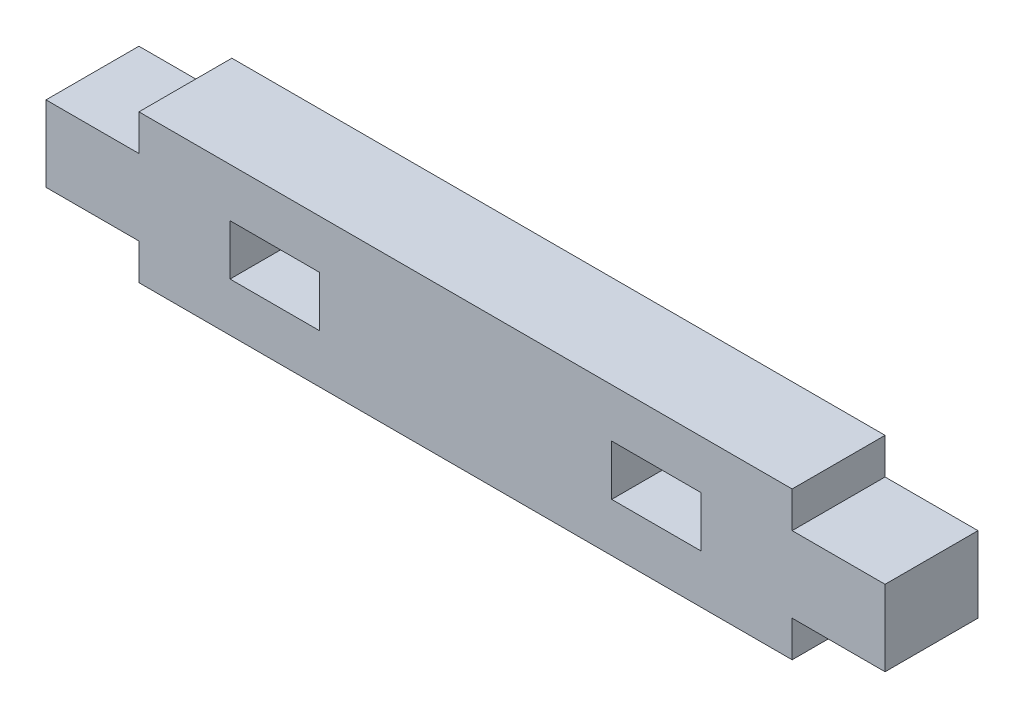
ISO-10303-21;
HEADER;
FILE_DESCRIPTION(('STEP AP214'),'2;1');
FILE_NAME('part.step','',(''),(''),'','','');
FILE_SCHEMA(('AUTOMOTIVE_DESIGN { 1 0 10303 214 1 1 1 1 }'));
ENDSEC;
DATA;
#1=APPLICATION_CONTEXT('core data for automotive mechanical design processes');
#2=APPLICATION_PROTOCOL_DEFINITION('international standard','automotive_design',2000,#1);
#3=PRODUCT_CONTEXT('',#1,'mechanical');
#4=PRODUCT('Part','Part','',(#3));
#5=PRODUCT_RELATED_PRODUCT_CATEGORY('part','',(#4));
#6=PRODUCT_DEFINITION_FORMATION('','',#4);
#7=PRODUCT_DEFINITION_CONTEXT('part definition',#1,'design');
#8=PRODUCT_DEFINITION('design','',#6,#7);
#9=PRODUCT_DEFINITION_SHAPE('','',#8);
#10=(LENGTH_UNIT() NAMED_UNIT(*) SI_UNIT(.MILLI.,.METRE.));
#11=(NAMED_UNIT(*) PLANE_ANGLE_UNIT() SI_UNIT($,.RADIAN.));
#12=(NAMED_UNIT(*) SI_UNIT($,.STERADIAN.) SOLID_ANGLE_UNIT());
#13=UNCERTAINTY_MEASURE_WITH_UNIT(LENGTH_MEASURE(1.E-05),#10,'distance_accuracy_value','');
#14=(GEOMETRIC_REPRESENTATION_CONTEXT(3) GLOBAL_UNCERTAINTY_ASSIGNED_CONTEXT((#13)) GLOBAL_UNIT_ASSIGNED_CONTEXT((#10,
#11,#12)) REPRESENTATION_CONTEXT('',''));
#15=CARTESIAN_POINT('',(0.,0.,0.));
#16=DIRECTION('',(0.,0.,1.));
#17=DIRECTION('',(1.,0.,0.));
#18=AXIS2_PLACEMENT_3D('',#15,#16,#17);
#19=CARTESIAN_POINT('',(-18.1,1.9,5.15));
#20=DIRECTION('',(0.,0.,-1.));
#21=DIRECTION('',(-1.,0.,0.));
#22=AXIS2_PLACEMENT_3D('',#19,#20,#21);
#23=PLANE('',#22);
#24=DIRECTION('',(1.,0.,0.));
#25=VECTOR('',#24,1.);
#26=CARTESIAN_POINT('',(8.1,2.6,5.15));
#27=LINE('',#26,#25);
#28=CARTESIAN_POINT('',(8.1,2.6,5.15));
#29=VERTEX_POINT('',#28);
#30=CARTESIAN_POINT('',(13.05,2.6,5.15));
#31=VERTEX_POINT('',#30);
#32=EDGE_CURVE('E188',#29,#31,#27,.T.);
#33=ORIENTED_EDGE('',*,*,#32,.F.);
#34=DIRECTION('',(0.,-1.,0.));
#35=VECTOR('',#34,1.);
#36=CARTESIAN_POINT('',(8.1,5.4,5.15));
#37=LINE('',#36,#35);
#38=CARTESIAN_POINT('',(8.1,5.4,5.15));
#39=VERTEX_POINT('',#38);
#40=EDGE_CURVE('E47',#39,#29,#37,.T.);
#41=ORIENTED_EDGE('',*,*,#40,.F.);
#42=DIRECTION('',(1.,0.,0.));
#43=VECTOR('',#42,1.);
#44=CARTESIAN_POINT('',(8.1,5.4,5.15));
#45=LINE('',#44,#43);
#46=CARTESIAN_POINT('',(13.05,5.4,5.15));
#47=VERTEX_POINT('',#46);
#48=EDGE_CURVE('E178',#39,#47,#45,.T.);
#49=ORIENTED_EDGE('',*,*,#48,.T.);
#50=DIRECTION('',(0.,-1.,0.));
#51=VECTOR('',#50,1.);
#52=CARTESIAN_POINT('',(13.05,5.4,5.15));
#53=LINE('',#52,#51);
#54=EDGE_CURVE('E184',#47,#31,#53,.T.);
#55=ORIENTED_EDGE('',*,*,#54,.T.);
#56=EDGE_LOOP('',(#33,#41,#49,#55));
#57=FACE_BOUND('',#56,.T.);
#58=DIRECTION('',(1.,0.,0.));
#59=VECTOR('',#58,1.);
#60=CARTESIAN_POINT('',(-23.25,1.9,5.15));
#61=LINE('',#60,#59);
#62=CARTESIAN_POINT('',(-23.25,1.9,5.15));
#63=VERTEX_POINT('',#62);
#64=CARTESIAN_POINT('',(-18.1,1.9,5.15));
#65=VERTEX_POINT('',#64);
#66=EDGE_CURVE('E235',#63,#65,#61,.T.);
#67=ORIENTED_EDGE('',*,*,#66,.T.);
#68=DIRECTION('',(0.,-1.,0.));
#69=VECTOR('',#68,1.);
#70=CARTESIAN_POINT('',(-18.1,1.9,5.15));
#71=LINE('',#70,#69);
#72=CARTESIAN_POINT('',(-18.1,-0.1,5.15));
#73=VERTEX_POINT('',#72);
#74=EDGE_CURVE('E238',#65,#73,#71,.T.);
#75=ORIENTED_EDGE('',*,*,#74,.T.);
#76=DIRECTION('',(1.,0.,0.));
#77=VECTOR('',#76,1.);
#78=CARTESIAN_POINT('',(-18.1,-0.1,5.15));
#79=LINE('',#78,#77);
#80=CARTESIAN_POINT('',(18.1,-0.0999999999999998,5.15));
#81=VERTEX_POINT('',#80);
#82=EDGE_CURVE('E241',#73,#81,#79,.T.);
#83=ORIENTED_EDGE('',*,*,#82,.T.);
#84=DIRECTION('',(0.,1.,0.));
#85=VECTOR('',#84,1.);
#86=CARTESIAN_POINT('',(18.1,1.9,5.15));
#87=LINE('',#86,#85);
#88=CARTESIAN_POINT('',(18.1,1.9,5.15));
#89=VERTEX_POINT('',#88);
#90=EDGE_CURVE('E243',#81,#89,#87,.T.);
#91=ORIENTED_EDGE('',*,*,#90,.T.);
#92=DIRECTION('',(1.,0.,0.));
#93=VECTOR('',#92,1.);
#94=CARTESIAN_POINT('',(23.25,1.9,5.15));
#95=LINE('',#94,#93);
#96=CARTESIAN_POINT('',(23.25,1.9,5.15));
#97=VERTEX_POINT('',#96);
#98=EDGE_CURVE('E245',#89,#97,#95,.T.);
#99=ORIENTED_EDGE('',*,*,#98,.T.);
#100=DIRECTION('',(0.,1.,0.));
#101=VECTOR('',#100,1.);
#102=CARTESIAN_POINT('',(23.25,6.1,5.15));
#103=LINE('',#102,#101);
#104=CARTESIAN_POINT('',(23.25,6.1,5.15));
#105=VERTEX_POINT('',#104);
#106=EDGE_CURVE('E247',#97,#105,#103,.T.);
#107=ORIENTED_EDGE('',*,*,#106,.T.);
#108=DIRECTION('',(-1.,0.,0.));
#109=VECTOR('',#108,1.);
#110=CARTESIAN_POINT('',(18.1,6.1,5.15));
#111=LINE('',#110,#109);
#112=CARTESIAN_POINT('',(18.1,6.1,5.15));
#113=VERTEX_POINT('',#112);
#114=EDGE_CURVE('E249',#105,#113,#111,.T.);
#115=ORIENTED_EDGE('',*,*,#114,.T.);
#116=DIRECTION('',(0.,1.,0.));
#117=VECTOR('',#116,1.);
#118=CARTESIAN_POINT('',(18.1,8.1,5.15));
#119=LINE('',#118,#117);
#120=CARTESIAN_POINT('',(18.1,8.1,5.15));
#121=VERTEX_POINT('',#120);
#122=EDGE_CURVE('E251',#113,#121,#119,.T.);
#123=ORIENTED_EDGE('',*,*,#122,.T.);
#124=DIRECTION('',(-1.,0.,0.));
#125=VECTOR('',#124,1.);
#126=CARTESIAN_POINT('',(-18.1,8.1,5.15));
#127=LINE('',#126,#125);
#128=CARTESIAN_POINT('',(-18.1,8.1,5.15));
#129=VERTEX_POINT('',#128);
#130=EDGE_CURVE('E253',#121,#129,#127,.T.);
#131=ORIENTED_EDGE('',*,*,#130,.T.);
#132=DIRECTION('',(0.,-1.,0.));
#133=VECTOR('',#132,1.);
#134=CARTESIAN_POINT('',(-18.1,8.1,5.15));
#135=LINE('',#134,#133);
#136=CARTESIAN_POINT('',(-18.1,6.1,5.15));
#137=VERTEX_POINT('',#136);
#138=EDGE_CURVE('E255',#129,#137,#135,.T.);
#139=ORIENTED_EDGE('',*,*,#138,.T.);
#140=DIRECTION('',(-1.,0.,0.));
#141=VECTOR('',#140,1.);
#142=CARTESIAN_POINT('',(-18.1,6.1,5.15));
#143=LINE('',#142,#141);
#144=CARTESIAN_POINT('',(-23.25,6.1,5.15));
#145=VERTEX_POINT('',#144);
#146=EDGE_CURVE('E257',#137,#145,#143,.T.);
#147=ORIENTED_EDGE('',*,*,#146,.T.);
#148=DIRECTION('',(0.,-1.,0.));
#149=VECTOR('',#148,1.);
#150=CARTESIAN_POINT('',(-23.25,6.1,5.15));
#151=LINE('',#150,#149);
#152=EDGE_CURVE('E259',#145,#63,#151,.T.);
#153=ORIENTED_EDGE('',*,*,#152,.T.);
#154=EDGE_LOOP('',(#67,#75,#83,#91,#99,#107,#115,#123,#131,#139,#147,#153));
#155=FACE_BOUND('',#154,.T.);
#156=DIRECTION('',(0.,-1.,0.));
#157=VECTOR('',#156,1.);
#158=CARTESIAN_POINT('',(-8.1,0.,5.15));
#159=LINE('',#158,#157);
#160=CARTESIAN_POINT('',(-8.1,5.4,5.15));
#161=VERTEX_POINT('',#160);
#162=CARTESIAN_POINT('',(-8.1,2.6,5.15));
#163=VERTEX_POINT('',#162);
#164=EDGE_CURVE('E189',#161,#163,#159,.T.);
#165=ORIENTED_EDGE('',*,*,#164,.T.);
#166=DIRECTION('',(-1.,0.,0.));
#167=VECTOR('',#166,1.);
#168=CARTESIAN_POINT('',(0.,2.6,5.15));
#169=LINE('',#168,#167);
#170=CARTESIAN_POINT('',(-13.05,2.6,5.15));
#171=VERTEX_POINT('',#170);
#172=EDGE_CURVE('E209',#163,#171,#169,.T.);
#173=ORIENTED_EDGE('',*,*,#172,.T.);
#174=DIRECTION('',(0.,-1.,0.));
#175=VECTOR('',#174,1.);
#176=CARTESIAN_POINT('',(-13.05,0.,5.15));
#177=LINE('',#176,#175);
#178=CARTESIAN_POINT('',(-13.05,5.4,5.15));
#179=VERTEX_POINT('',#178);
#180=EDGE_CURVE('E220',#179,#171,#177,.T.);
#181=ORIENTED_EDGE('',*,*,#180,.F.);
#182=DIRECTION('',(-1.,0.,0.));
#183=VECTOR('',#182,1.);
#184=CARTESIAN_POINT('',(0.,5.4,5.15));
#185=LINE('',#184,#183);
#186=EDGE_CURVE('E192',#161,#179,#185,.T.);
#187=ORIENTED_EDGE('',*,*,#186,.F.);
#188=EDGE_LOOP('',(#165,#173,#181,#187));
#189=FACE_BOUND('',#188,.T.);
#190=ADVANCED_FACE('F32',(#57,#155,#189),#23,.F.);
#191=CARTESIAN_POINT('',(-18.1,1.9,0.));
#192=DIRECTION('',(0.,0.,-1.));
#193=DIRECTION('',(-1.,0.,0.));
#194=AXIS2_PLACEMENT_3D('',#191,#192,#193);
#195=PLANE('',#194);
#196=DIRECTION('',(0.,-1.,0.));
#197=VECTOR('',#196,1.);
#198=CARTESIAN_POINT('',(8.1,5.4,0.));
#199=LINE('',#198,#197);
#200=CARTESIAN_POINT('',(8.1,5.4,0.));
#201=VERTEX_POINT('',#200);
#202=CARTESIAN_POINT('',(8.1,2.6,0.));
#203=VERTEX_POINT('',#202);
#204=EDGE_CURVE('E172',#201,#203,#199,.T.);
#205=ORIENTED_EDGE('',*,*,#204,.T.);
#206=DIRECTION('',(1.,0.,0.));
#207=VECTOR('',#206,1.);
#208=CARTESIAN_POINT('',(8.1,2.6,0.));
#209=LINE('',#208,#207);
#210=CARTESIAN_POINT('',(13.05,2.6,0.));
#211=VERTEX_POINT('',#210);
#212=EDGE_CURVE('E202',#203,#211,#209,.T.);
#213=ORIENTED_EDGE('',*,*,#212,.T.);
#214=DIRECTION('',(0.,-1.,0.));
#215=VECTOR('',#214,1.);
#216=CARTESIAN_POINT('',(13.05,5.4,0.));
#217=LINE('',#216,#215);
#218=CARTESIAN_POINT('',(13.05,5.4,0.));
#219=VERTEX_POINT('',#218);
#220=EDGE_CURVE('E199',#219,#211,#217,.T.);
#221=ORIENTED_EDGE('',*,*,#220,.F.);
#222=DIRECTION('',(1.,0.,0.));
#223=VECTOR('',#222,1.);
#224=CARTESIAN_POINT('',(8.1,5.4,0.));
#225=LINE('',#224,#223);
#226=EDGE_CURVE('E197',#201,#219,#225,.T.);
#227=ORIENTED_EDGE('',*,*,#226,.F.);
#228=EDGE_LOOP('',(#205,#213,#221,#227));
#229=FACE_BOUND('',#228,.T.);
#230=DIRECTION('',(1.,0.,0.));
#231=VECTOR('',#230,1.);
#232=CARTESIAN_POINT('',(-23.25,1.9,0.));
#233=LINE('',#232,#231);
#234=CARTESIAN_POINT('',(-23.25,1.9,0.));
#235=VERTEX_POINT('',#234);
#236=CARTESIAN_POINT('',(-18.1,1.9,0.));
#237=VERTEX_POINT('',#236);
#238=EDGE_CURVE('E228',#235,#237,#233,.T.);
#239=ORIENTED_EDGE('',*,*,#238,.F.);
#240=DIRECTION('',(0.,-1.,0.));
#241=VECTOR('',#240,1.);
#242=CARTESIAN_POINT('',(-23.25,6.1,0.));
#243=LINE('',#242,#241);
#244=CARTESIAN_POINT('',(-23.25,6.1,0.));
#245=VERTEX_POINT('',#244);
#246=EDGE_CURVE('E239',#245,#235,#243,.T.);
#247=ORIENTED_EDGE('',*,*,#246,.F.);
#248=DIRECTION('',(-1.,0.,0.));
#249=VECTOR('',#248,1.);
#250=CARTESIAN_POINT('',(-18.1,6.1,0.));
#251=LINE('',#250,#249);
#252=CARTESIAN_POINT('',(-18.1,6.1,0.));
#253=VERTEX_POINT('',#252);
#254=EDGE_CURVE('E283',#253,#245,#251,.T.);
#255=ORIENTED_EDGE('',*,*,#254,.F.);
#256=DIRECTION('',(0.,-1.,0.));
#257=VECTOR('',#256,1.);
#258=CARTESIAN_POINT('',(-18.1,8.1,0.));
#259=LINE('',#258,#257);
#260=CARTESIAN_POINT('',(-18.1,8.1,0.));
#261=VERTEX_POINT('',#260);
#262=EDGE_CURVE('E281',#261,#253,#259,.T.);
#263=ORIENTED_EDGE('',*,*,#262,.F.);
#264=DIRECTION('',(-1.,0.,0.));
#265=VECTOR('',#264,1.);
#266=CARTESIAN_POINT('',(-18.1,8.1,0.));
#267=LINE('',#266,#265);
#268=CARTESIAN_POINT('',(18.1,8.1,0.));
#269=VERTEX_POINT('',#268);
#270=EDGE_CURVE('E279',#269,#261,#267,.T.);
#271=ORIENTED_EDGE('',*,*,#270,.F.);
#272=DIRECTION('',(0.,1.,0.));
#273=VECTOR('',#272,1.);
#274=CARTESIAN_POINT('',(18.1,8.1,0.));
#275=LINE('',#274,#273);
#276=CARTESIAN_POINT('',(18.1,6.1,0.));
#277=VERTEX_POINT('',#276);
#278=EDGE_CURVE('E277',#277,#269,#275,.T.);
#279=ORIENTED_EDGE('',*,*,#278,.F.);
#280=DIRECTION('',(-1.,0.,0.));
#281=VECTOR('',#280,1.);
#282=CARTESIAN_POINT('',(18.1,6.1,0.));
#283=LINE('',#282,#281);
#284=CARTESIAN_POINT('',(23.25,6.1,0.));
#285=VERTEX_POINT('',#284);
#286=EDGE_CURVE('E275',#285,#277,#283,.T.);
#287=ORIENTED_EDGE('',*,*,#286,.F.);
#288=DIRECTION('',(0.,1.,0.));
#289=VECTOR('',#288,1.);
#290=CARTESIAN_POINT('',(23.25,6.1,0.));
#291=LINE('',#290,#289);
#292=CARTESIAN_POINT('',(23.25,1.9,0.));
#293=VERTEX_POINT('',#292);
#294=EDGE_CURVE('E273',#293,#285,#291,.T.);
#295=ORIENTED_EDGE('',*,*,#294,.F.);
#296=DIRECTION('',(1.,0.,0.));
#297=VECTOR('',#296,1.);
#298=CARTESIAN_POINT('',(23.25,1.9,0.));
#299=LINE('',#298,#297);
#300=CARTESIAN_POINT('',(18.1,1.9,0.));
#301=VERTEX_POINT('',#300);
#302=EDGE_CURVE('E271',#301,#293,#299,.T.);
#303=ORIENTED_EDGE('',*,*,#302,.F.);
#304=DIRECTION('',(0.,1.,0.));
#305=VECTOR('',#304,1.);
#306=CARTESIAN_POINT('',(18.1,1.9,0.));
#307=LINE('',#306,#305);
#308=CARTESIAN_POINT('',(18.1,-0.0999999999999998,0.));
#309=VERTEX_POINT('',#308);
#310=EDGE_CURVE('E269',#309,#301,#307,.T.);
#311=ORIENTED_EDGE('',*,*,#310,.F.);
#312=DIRECTION('',(1.,0.,0.));
#313=VECTOR('',#312,1.);
#314=CARTESIAN_POINT('',(18.1,-0.0999999999999998,0.));
#315=LINE('',#314,#313);
#316=CARTESIAN_POINT('',(-18.1,-0.1,0.));
#317=VERTEX_POINT('',#316);
#318=EDGE_CURVE('E267',#317,#309,#315,.T.);
#319=ORIENTED_EDGE('',*,*,#318,.F.);
#320=DIRECTION('',(0.,-1.,0.));
#321=VECTOR('',#320,1.);
#322=CARTESIAN_POINT('',(-18.1,1.9,0.));
#323=LINE('',#322,#321);
#324=EDGE_CURVE('E264',#237,#317,#323,.T.);
#325=ORIENTED_EDGE('',*,*,#324,.F.);
#326=EDGE_LOOP('',(#239,#247,#255,#263,#271,#279,#287,#295,#303,#311,#319,#325));
#327=FACE_BOUND('',#326,.T.);
#328=DIRECTION('',(-1.,0.,0.));
#329=VECTOR('',#328,1.);
#330=CARTESIAN_POINT('',(0.,2.6,0.));
#331=LINE('',#330,#329);
#332=CARTESIAN_POINT('',(-8.1,2.6,0.));
#333=VERTEX_POINT('',#332);
#334=CARTESIAN_POINT('',(-13.05,2.6,0.));
#335=VERTEX_POINT('',#334);
#336=EDGE_CURVE('E215',#333,#335,#331,.T.);
#337=ORIENTED_EDGE('',*,*,#336,.F.);
#338=DIRECTION('',(0.,-1.,0.));
#339=VECTOR('',#338,1.);
#340=CARTESIAN_POINT('',(-8.1,0.,0.));
#341=LINE('',#340,#339);
#342=CARTESIAN_POINT('',(-8.1,5.4,0.));
#343=VERTEX_POINT('',#342);
#344=EDGE_CURVE('E206',#343,#333,#341,.T.);
#345=ORIENTED_EDGE('',*,*,#344,.F.);
#346=DIRECTION('',(-1.,0.,0.));
#347=VECTOR('',#346,1.);
#348=CARTESIAN_POINT('',(0.,5.4,0.));
#349=LINE('',#348,#347);
#350=CARTESIAN_POINT('',(-13.05,5.4,0.));
#351=VERTEX_POINT('',#350);
#352=EDGE_CURVE('E208',#343,#351,#349,.T.);
#353=ORIENTED_EDGE('',*,*,#352,.T.);
#354=DIRECTION('',(0.,-1.,0.));
#355=VECTOR('',#354,1.);
#356=CARTESIAN_POINT('',(-13.05,0.,0.));
#357=LINE('',#356,#355);
#358=EDGE_CURVE('E212',#351,#335,#357,.T.);
#359=ORIENTED_EDGE('',*,*,#358,.T.);
#360=EDGE_LOOP('',(#337,#345,#353,#359));
#361=FACE_BOUND('',#360,.T.);
#362=ADVANCED_FACE('F325',(#229,#327,#361),#195,.T.);
#363=CARTESIAN_POINT('',(-23.25,1.9,5.15));
#364=DIRECTION('',(0.,1.,0.));
#365=DIRECTION('',(0.,0.,1.));
#366=AXIS2_PLACEMENT_3D('',#363,#364,#365);
#367=PLANE('',#366);
#368=ORIENTED_EDGE('',*,*,#238,.T.);
#369=DIRECTION('',(0.,0.,-1.));
#370=VECTOR('',#369,1.);
#371=CARTESIAN_POINT('',(-18.1,1.9,5.15));
#372=LINE('',#371,#370);
#373=EDGE_CURVE('E11',#65,#237,#372,.T.);
#374=ORIENTED_EDGE('',*,*,#373,.F.);
#375=ORIENTED_EDGE('',*,*,#66,.F.);
#376=DIRECTION('',(0.,0.,-1.));
#377=VECTOR('',#376,1.);
#378=CARTESIAN_POINT('',(-23.25,1.9,5.15));
#379=LINE('',#378,#377);
#380=EDGE_CURVE('E261',#63,#235,#379,.T.);
#381=ORIENTED_EDGE('',*,*,#380,.T.);
#382=EDGE_LOOP('',(#368,#374,#375,#381));
#383=FACE_BOUND('',#382,.T.);
#384=ADVANCED_FACE('F34',(#383),#367,.F.);
#385=CARTESIAN_POINT('',(-18.1,1.9,5.15));
#386=DIRECTION('',(1.,0.,0.));
#387=DIRECTION('',(0.,0.,-1.));
#388=AXIS2_PLACEMENT_3D('',#385,#386,#387);
#389=PLANE('',#388);
#390=ORIENTED_EDGE('',*,*,#324,.T.);
#391=DIRECTION('',(0.,0.,-1.));
#392=VECTOR('',#391,1.);
#393=CARTESIAN_POINT('',(-18.1,-0.1,5.15));
#394=LINE('',#393,#392);
#395=EDGE_CURVE('E40',#73,#317,#394,.T.);
#396=ORIENTED_EDGE('',*,*,#395,.F.);
#397=ORIENTED_EDGE('',*,*,#74,.F.);
#398=ORIENTED_EDGE('',*,*,#373,.T.);
#399=EDGE_LOOP('',(#390,#396,#397,#398));
#400=FACE_BOUND('',#399,.T.);
#401=ADVANCED_FACE('F321',(#400),#389,.F.);
#402=CARTESIAN_POINT('',(18.1,-0.0999999999999998,5.15));
#403=DIRECTION('',(0.,1.,0.));
#404=DIRECTION('',(-1.,0.,0.));
#405=AXIS2_PLACEMENT_3D('',#402,#403,#404);
#406=PLANE('',#405);
#407=ORIENTED_EDGE('',*,*,#318,.T.);
#408=DIRECTION('',(0.,0.,-1.));
#409=VECTOR('',#408,1.);
#410=CARTESIAN_POINT('',(18.1,-0.0999999999999998,5.15));
#411=LINE('',#410,#409);
#412=EDGE_CURVE('E312',#81,#309,#411,.T.);
#413=ORIENTED_EDGE('',*,*,#412,.F.);
#414=ORIENTED_EDGE('',*,*,#82,.F.);
#415=ORIENTED_EDGE('',*,*,#395,.T.);
#416=EDGE_LOOP('',(#407,#413,#414,#415));
#417=FACE_BOUND('',#416,.T.);
#418=ADVANCED_FACE('F318',(#417),#406,.F.);
#419=CARTESIAN_POINT('',(18.1,1.9,5.15));
#420=DIRECTION('',(-1.,0.,0.));
#421=DIRECTION('',(0.,0.,1.));
#422=AXIS2_PLACEMENT_3D('',#419,#420,#421);
#423=PLANE('',#422);
#424=ORIENTED_EDGE('',*,*,#310,.T.);
#425=DIRECTION('',(0.,0.,-1.));
#426=VECTOR('',#425,1.);
#427=CARTESIAN_POINT('',(18.1,1.9,5.15));
#428=LINE('',#427,#426);
#429=EDGE_CURVE('E309',#89,#301,#428,.T.);
#430=ORIENTED_EDGE('',*,*,#429,.F.);
#431=ORIENTED_EDGE('',*,*,#90,.F.);
#432=ORIENTED_EDGE('',*,*,#412,.T.);
#433=EDGE_LOOP('',(#424,#430,#431,#432));
#434=FACE_BOUND('',#433,.T.);
#435=ADVANCED_FACE('F333',(#434),#423,.F.);
#436=CARTESIAN_POINT('',(23.25,1.9,5.15));
#437=DIRECTION('',(0.,1.,0.));
#438=DIRECTION('',(-1.,0.,0.));
#439=AXIS2_PLACEMENT_3D('',#436,#437,#438);
#440=PLANE('',#439);
#441=ORIENTED_EDGE('',*,*,#302,.T.);
#442=DIRECTION('',(0.,0.,-1.));
#443=VECTOR('',#442,1.);
#444=CARTESIAN_POINT('',(23.25,1.9,5.15));
#445=LINE('',#444,#443);
#446=EDGE_CURVE('E306',#97,#293,#445,.T.);
#447=ORIENTED_EDGE('',*,*,#446,.F.);
#448=ORIENTED_EDGE('',*,*,#98,.F.);
#449=ORIENTED_EDGE('',*,*,#429,.T.);
#450=EDGE_LOOP('',(#441,#447,#448,#449));
#451=FACE_BOUND('',#450,.T.);
#452=ADVANCED_FACE('F337',(#451),#440,.F.);
#453=CARTESIAN_POINT('',(23.25,6.1,5.15));
#454=DIRECTION('',(-1.,0.,0.));
#455=DIRECTION('',(0.,0.,1.));
#456=AXIS2_PLACEMENT_3D('',#453,#454,#455);
#457=PLANE('',#456);
#458=ORIENTED_EDGE('',*,*,#294,.T.);
#459=DIRECTION('',(0.,0.,-1.));
#460=VECTOR('',#459,1.);
#461=CARTESIAN_POINT('',(23.25,6.1,5.15));
#462=LINE('',#461,#460);
#463=EDGE_CURVE('E303',#105,#285,#462,.T.);
#464=ORIENTED_EDGE('',*,*,#463,.F.);
#465=ORIENTED_EDGE('',*,*,#106,.F.);
#466=ORIENTED_EDGE('',*,*,#446,.T.);
#467=EDGE_LOOP('',(#458,#464,#465,#466));
#468=FACE_BOUND('',#467,.T.);
#469=ADVANCED_FACE('F374',(#468),#457,.F.);
#470=CARTESIAN_POINT('',(18.1,6.1,5.15));
#471=DIRECTION('',(0.,-1.,0.));
#472=DIRECTION('',(0.,0.,-1.));
#473=AXIS2_PLACEMENT_3D('',#470,#471,#472);
#474=PLANE('',#473);
#475=ORIENTED_EDGE('',*,*,#286,.T.);
#476=DIRECTION('',(0.,0.,-1.));
#477=VECTOR('',#476,1.);
#478=CARTESIAN_POINT('',(18.1,6.1,5.15));
#479=LINE('',#478,#477);
#480=EDGE_CURVE('E300',#113,#277,#479,.T.);
#481=ORIENTED_EDGE('',*,*,#480,.F.);
#482=ORIENTED_EDGE('',*,*,#114,.F.);
#483=ORIENTED_EDGE('',*,*,#463,.T.);
#484=EDGE_LOOP('',(#475,#481,#482,#483));
#485=FACE_BOUND('',#484,.T.);
#486=ADVANCED_FACE('F372',(#485),#474,.F.);
#487=CARTESIAN_POINT('',(18.1,8.1,5.15));
#488=DIRECTION('',(-1.,0.,0.));
#489=DIRECTION('',(0.,-1.,0.));
#490=AXIS2_PLACEMENT_3D('',#487,#488,#489);
#491=PLANE('',#490);
#492=ORIENTED_EDGE('',*,*,#278,.T.);
#493=DIRECTION('',(0.,0.,-1.));
#494=VECTOR('',#493,1.);
#495=CARTESIAN_POINT('',(18.1,8.1,5.15));
#496=LINE('',#495,#494);
#497=EDGE_CURVE('E297',#121,#269,#496,.T.);
#498=ORIENTED_EDGE('',*,*,#497,.F.);
#499=ORIENTED_EDGE('',*,*,#122,.F.);
#500=ORIENTED_EDGE('',*,*,#480,.T.);
#501=EDGE_LOOP('',(#492,#498,#499,#500));
#502=FACE_BOUND('',#501,.T.);
#503=ADVANCED_FACE('F367',(#502),#491,.F.);
#504=CARTESIAN_POINT('',(-18.1,8.1,5.15));
#505=DIRECTION('',(0.,-1.,0.));
#506=DIRECTION('',(0.,0.,-1.));
#507=AXIS2_PLACEMENT_3D('',#504,#505,#506);
#508=PLANE('',#507);
#509=ORIENTED_EDGE('',*,*,#270,.T.);
#510=DIRECTION('',(0.,0.,-1.));
#511=VECTOR('',#510,1.);
#512=CARTESIAN_POINT('',(-18.1,8.1,5.15));
#513=LINE('',#512,#511);
#514=EDGE_CURVE('E294',#129,#261,#513,.T.);
#515=ORIENTED_EDGE('',*,*,#514,.F.);
#516=ORIENTED_EDGE('',*,*,#130,.F.);
#517=ORIENTED_EDGE('',*,*,#497,.T.);
#518=EDGE_LOOP('',(#509,#515,#516,#517));
#519=FACE_BOUND('',#518,.T.);
#520=ADVANCED_FACE('F362',(#519),#508,.F.);
#521=CARTESIAN_POINT('',(-18.1,8.1,5.15));
#522=DIRECTION('',(1.,0.,0.));
#523=DIRECTION('',(0.,0.,-1.));
#524=AXIS2_PLACEMENT_3D('',#521,#522,#523);
#525=PLANE('',#524);
#526=ORIENTED_EDGE('',*,*,#262,.T.);
#527=DIRECTION('',(0.,0.,-1.));
#528=VECTOR('',#527,1.);
#529=CARTESIAN_POINT('',(-18.1,6.1,5.15));
#530=LINE('',#529,#528);
#531=EDGE_CURVE('E291',#137,#253,#530,.T.);
#532=ORIENTED_EDGE('',*,*,#531,.F.);
#533=ORIENTED_EDGE('',*,*,#138,.F.);
#534=ORIENTED_EDGE('',*,*,#514,.T.);
#535=EDGE_LOOP('',(#526,#532,#533,#534));
#536=FACE_BOUND('',#535,.T.);
#537=ADVANCED_FACE('F358',(#536),#525,.F.);
#538=CARTESIAN_POINT('',(-18.1,6.1,5.15));
#539=DIRECTION('',(0.,-1.,0.));
#540=DIRECTION('',(0.,0.,-1.));
#541=AXIS2_PLACEMENT_3D('',#538,#539,#540);
#542=PLANE('',#541);
#543=ORIENTED_EDGE('',*,*,#254,.T.);
#544=DIRECTION('',(0.,0.,-1.));
#545=VECTOR('',#544,1.);
#546=CARTESIAN_POINT('',(-23.25,6.1,5.15));
#547=LINE('',#546,#545);
#548=EDGE_CURVE('E288',#145,#245,#547,.T.);
#549=ORIENTED_EDGE('',*,*,#548,.F.);
#550=ORIENTED_EDGE('',*,*,#146,.F.);
#551=ORIENTED_EDGE('',*,*,#531,.T.);
#552=EDGE_LOOP('',(#543,#549,#550,#551));
#553=FACE_BOUND('',#552,.T.);
#554=ADVANCED_FACE('F353',(#553),#542,.F.);
#555=CARTESIAN_POINT('',(-23.25,6.1,5.15));
#556=DIRECTION('',(1.,0.,0.));
#557=DIRECTION('',(0.,0.,-1.));
#558=AXIS2_PLACEMENT_3D('',#555,#556,#557);
#559=PLANE('',#558);
#560=ORIENTED_EDGE('',*,*,#246,.T.);
#561=ORIENTED_EDGE('',*,*,#380,.F.);
#562=ORIENTED_EDGE('',*,*,#152,.F.);
#563=ORIENTED_EDGE('',*,*,#548,.T.);
#564=EDGE_LOOP('',(#560,#561,#562,#563));
#565=FACE_BOUND('',#564,.T.);
#566=ADVANCED_FACE('F347',(#565),#559,.F.);
#567=CARTESIAN_POINT('',(-8.1,0.,0.));
#568=DIRECTION('',(-1.,0.,0.));
#569=DIRECTION('',(0.,0.,1.));
#570=AXIS2_PLACEMENT_3D('',#567,#568,#569);
#571=PLANE('',#570);
#572=ORIENTED_EDGE('',*,*,#164,.F.);
#573=DIRECTION('',(0.,0.,1.));
#574=VECTOR('',#573,1.);
#575=CARTESIAN_POINT('',(-8.1,5.4,0.));
#576=LINE('',#575,#574);
#577=EDGE_CURVE('E216',#343,#161,#576,.T.);
#578=ORIENTED_EDGE('',*,*,#577,.F.);
#579=ORIENTED_EDGE('',*,*,#344,.T.);
#580=DIRECTION('',(0.,0.,1.));
#581=VECTOR('',#580,1.);
#582=CARTESIAN_POINT('',(-8.1,2.6,0.));
#583=LINE('',#582,#581);
#584=EDGE_CURVE('E225',#333,#163,#583,.T.);
#585=ORIENTED_EDGE('',*,*,#584,.T.);
#586=EDGE_LOOP('',(#572,#578,#579,#585));
#587=FACE_BOUND('',#586,.T.);
#588=ADVANCED_FACE('F391',(#587),#571,.T.);
#589=CARTESIAN_POINT('',(0.,2.6,0.));
#590=DIRECTION('',(0.,1.,0.));
#591=DIRECTION('',(0.,0.,1.));
#592=AXIS2_PLACEMENT_3D('',#589,#590,#591);
#593=PLANE('',#592);
#594=ORIENTED_EDGE('',*,*,#172,.F.);
#595=ORIENTED_EDGE('',*,*,#584,.F.);
#596=ORIENTED_EDGE('',*,*,#336,.T.);
#597=DIRECTION('',(0.,0.,1.));
#598=VECTOR('',#597,1.);
#599=CARTESIAN_POINT('',(-13.05,2.6,0.));
#600=LINE('',#599,#598);
#601=EDGE_CURVE('E229',#335,#171,#600,.T.);
#602=ORIENTED_EDGE('',*,*,#601,.T.);
#603=EDGE_LOOP('',(#594,#595,#596,#602));
#604=FACE_BOUND('',#603,.T.);
#605=ADVANCED_FACE('F429',(#604),#593,.T.);
#606=CARTESIAN_POINT('',(-13.05,0.,0.));
#607=DIRECTION('',(-1.,0.,0.));
#608=DIRECTION('',(0.,0.,1.));
#609=AXIS2_PLACEMENT_3D('',#606,#607,#608);
#610=PLANE('',#609);
#611=ORIENTED_EDGE('',*,*,#180,.T.);
#612=ORIENTED_EDGE('',*,*,#601,.F.);
#613=ORIENTED_EDGE('',*,*,#358,.F.);
#614=DIRECTION('',(0.,0.,1.));
#615=VECTOR('',#614,1.);
#616=CARTESIAN_POINT('',(-13.05,5.4,0.));
#617=LINE('',#616,#615);
#618=EDGE_CURVE('E231',#351,#179,#617,.T.);
#619=ORIENTED_EDGE('',*,*,#618,.T.);
#620=EDGE_LOOP('',(#611,#612,#613,#619));
#621=FACE_BOUND('',#620,.T.);
#622=ADVANCED_FACE('F437',(#621),#610,.F.);
#623=CARTESIAN_POINT('',(0.,5.4,0.));
#624=DIRECTION('',(0.,1.,0.));
#625=DIRECTION('',(0.,0.,1.));
#626=AXIS2_PLACEMENT_3D('',#623,#624,#625);
#627=PLANE('',#626);
#628=ORIENTED_EDGE('',*,*,#186,.T.);
#629=ORIENTED_EDGE('',*,*,#618,.F.);
#630=ORIENTED_EDGE('',*,*,#352,.F.);
#631=ORIENTED_EDGE('',*,*,#577,.T.);
#632=EDGE_LOOP('',(#628,#629,#630,#631));
#633=FACE_BOUND('',#632,.T.);
#634=ADVANCED_FACE('F445',(#633),#627,.F.);
#635=CARTESIAN_POINT('',(8.1,5.4,0.));
#636=DIRECTION('',(-1.,0.,0.));
#637=DIRECTION('',(0.,0.,1.));
#638=AXIS2_PLACEMENT_3D('',#635,#636,#637);
#639=PLANE('',#638);
#640=ORIENTED_EDGE('',*,*,#40,.T.);
#641=DIRECTION('',(0.,0.,1.));
#642=VECTOR('',#641,1.);
#643=CARTESIAN_POINT('',(8.1,2.6,0.));
#644=LINE('',#643,#642);
#645=EDGE_CURVE('E200',#203,#29,#644,.T.);
#646=ORIENTED_EDGE('',*,*,#645,.F.);
#647=ORIENTED_EDGE('',*,*,#204,.F.);
#648=DIRECTION('',(0.,0.,1.));
#649=VECTOR('',#648,1.);
#650=CARTESIAN_POINT('',(8.1,5.4,0.));
#651=LINE('',#650,#649);
#652=EDGE_CURVE('E168',#201,#39,#651,.T.);
#653=ORIENTED_EDGE('',*,*,#652,.T.);
#654=EDGE_LOOP('',(#640,#646,#647,#653));
#655=FACE_BOUND('',#654,.T.);
#656=ADVANCED_FACE('F170',(#655),#639,.F.);
#657=CARTESIAN_POINT('',(8.1,5.4,0.));
#658=DIRECTION('',(0.,-1.,0.));
#659=DIRECTION('',(0.,0.,-1.));
#660=AXIS2_PLACEMENT_3D('',#657,#658,#659);
#661=PLANE('',#660);
#662=ORIENTED_EDGE('',*,*,#48,.F.);
#663=ORIENTED_EDGE('',*,*,#652,.F.);
#664=ORIENTED_EDGE('',*,*,#226,.T.);
#665=DIRECTION('',(0.,0.,1.));
#666=VECTOR('',#665,1.);
#667=CARTESIAN_POINT('',(13.05,5.4,0.));
#668=LINE('',#667,#666);
#669=EDGE_CURVE('E175',#219,#47,#668,.T.);
#670=ORIENTED_EDGE('',*,*,#669,.T.);
#671=EDGE_LOOP('',(#662,#663,#664,#670));
#672=FACE_BOUND('',#671,.T.);
#673=ADVANCED_FACE('F179',(#672),#661,.T.);
#674=CARTESIAN_POINT('',(13.05,5.4,0.));
#675=DIRECTION('',(-1.,0.,0.));
#676=DIRECTION('',(0.,0.,1.));
#677=AXIS2_PLACEMENT_3D('',#674,#675,#676);
#678=PLANE('',#677);
#679=ORIENTED_EDGE('',*,*,#54,.F.);
#680=ORIENTED_EDGE('',*,*,#669,.F.);
#681=ORIENTED_EDGE('',*,*,#220,.T.);
#682=DIRECTION('',(0.,0.,1.));
#683=VECTOR('',#682,1.);
#684=CARTESIAN_POINT('',(13.05,2.6,0.));
#685=LINE('',#684,#683);
#686=EDGE_CURVE('E55',#211,#31,#685,.T.);
#687=ORIENTED_EDGE('',*,*,#686,.T.);
#688=EDGE_LOOP('',(#679,#680,#681,#687));
#689=FACE_BOUND('',#688,.T.);
#690=ADVANCED_FACE('F465',(#689),#678,.T.);
#691=CARTESIAN_POINT('',(8.1,2.6,0.));
#692=DIRECTION('',(0.,-1.,0.));
#693=DIRECTION('',(0.,0.,-1.));
#694=AXIS2_PLACEMENT_3D('',#691,#692,#693);
#695=PLANE('',#694);
#696=ORIENTED_EDGE('',*,*,#32,.T.);
#697=ORIENTED_EDGE('',*,*,#686,.F.);
#698=ORIENTED_EDGE('',*,*,#212,.F.);
#699=ORIENTED_EDGE('',*,*,#645,.T.);
#700=EDGE_LOOP('',(#696,#697,#698,#699));
#701=FACE_BOUND('',#700,.T.);
#702=ADVANCED_FACE('F472',(#701),#695,.F.);
#703=CLOSED_SHELL('',(#190,#362,#384,#401,#418,#435,#452,#469,#486,#503,#520,#537,#554,#566,
#588,#605,#622,#634,#656,#673,#690,#702));
#704=MANIFOLD_SOLID_BREP('B2',#703);
#705=ADVANCED_BREP_SHAPE_REPRESENTATION('',(#18,#704),#14);
#706=SHAPE_DEFINITION_REPRESENTATION(#9,#705);
ENDSEC;
END-ISO-10303-21;
